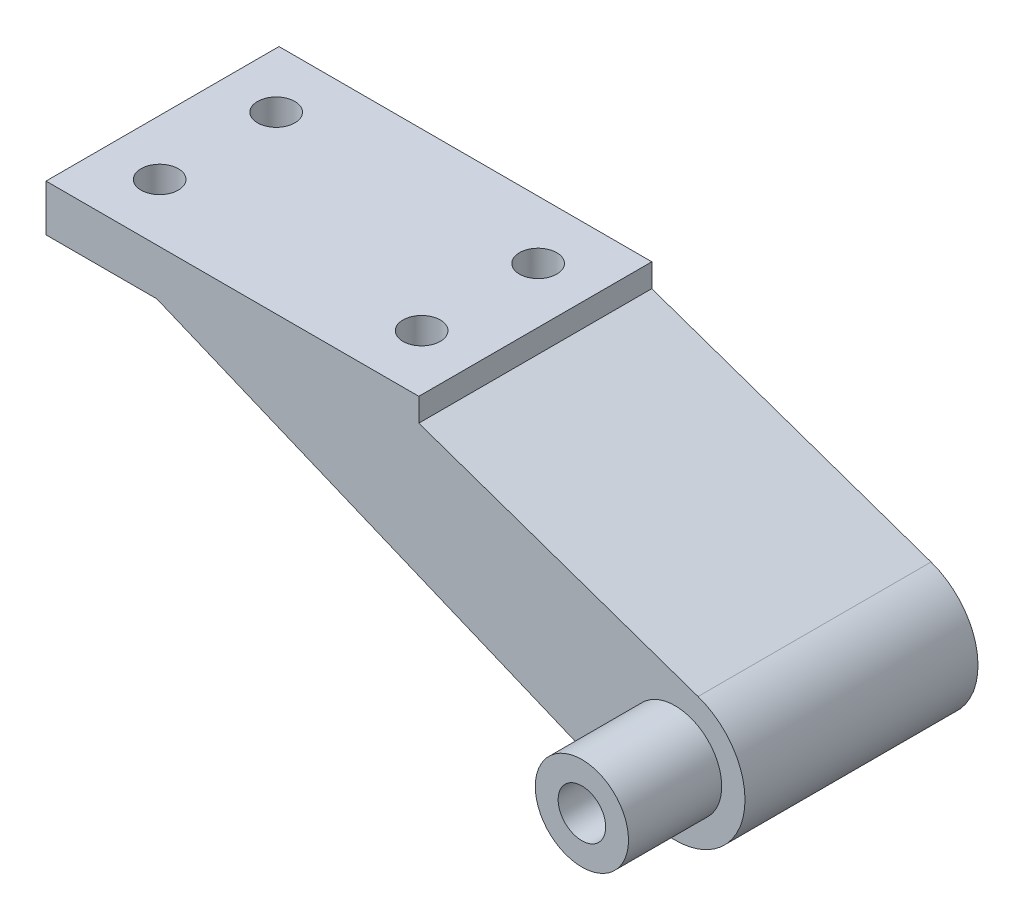
ISO-10303-21;
HEADER;
FILE_DESCRIPTION(('STEP AP214'),'2;1');
FILE_NAME('part.step','',(''),(''),'','','');
FILE_SCHEMA(('AUTOMOTIVE_DESIGN { 1 0 10303 214 1 1 1 1 }'));
ENDSEC;
DATA;
#1=APPLICATION_CONTEXT('core data for automotive mechanical design processes');
#2=APPLICATION_PROTOCOL_DEFINITION('international standard','automotive_design',2000,#1);
#3=PRODUCT_CONTEXT('',#1,'mechanical');
#4=PRODUCT('Part','Part','',(#3));
#5=PRODUCT_RELATED_PRODUCT_CATEGORY('part','',(#4));
#6=PRODUCT_DEFINITION_FORMATION('','',#4);
#7=PRODUCT_DEFINITION_CONTEXT('part definition',#1,'design');
#8=PRODUCT_DEFINITION('design','',#6,#7);
#9=PRODUCT_DEFINITION_SHAPE('','',#8);
#10=(LENGTH_UNIT() NAMED_UNIT(*) SI_UNIT(.MILLI.,.METRE.));
#11=(NAMED_UNIT(*) PLANE_ANGLE_UNIT() SI_UNIT($,.RADIAN.));
#12=(NAMED_UNIT(*) SI_UNIT($,.STERADIAN.) SOLID_ANGLE_UNIT());
#13=UNCERTAINTY_MEASURE_WITH_UNIT(LENGTH_MEASURE(1.E-05),#10,'distance_accuracy_value','');
#14=(GEOMETRIC_REPRESENTATION_CONTEXT(3) GLOBAL_UNCERTAINTY_ASSIGNED_CONTEXT((#13)) GLOBAL_UNIT_ASSIGNED_CONTEXT((#10,
#11,#12)) REPRESENTATION_CONTEXT('',''));
#15=CARTESIAN_POINT('',(0.,0.,0.));
#16=DIRECTION('',(0.,0.,1.));
#17=DIRECTION('',(1.,0.,0.));
#18=AXIS2_PLACEMENT_3D('',#15,#16,#17);
#19=CARTESIAN_POINT('',(43.2475049791949,-28.575,-7.9375));
#20=DIRECTION('',(0.,1.,0.));
#21=DIRECTION('',(0.,0.,1.));
#22=AXIS2_PLACEMENT_3D('',#19,#20,#21);
#23=CYLINDRICAL_SURFACE('',#22,2.54);
#24=CARTESIAN_POINT('',(43.2475049791949,6.35,-7.9375));
#25=DIRECTION('',(0.,1.,0.));
#26=DIRECTION('',(0.,0.,1.));
#27=AXIS2_PLACEMENT_3D('',#24,#25,#26);
#28=CIRCLE('',#27,2.54);
#29=CARTESIAN_POINT('',(43.2475049791949,6.35,-5.3975));
#30=VERTEX_POINT('',#29);
#31=EDGE_CURVE('E178',#30,#30,#28,.T.);
#32=ORIENTED_EDGE('',*,*,#31,.T.);
#33=EDGE_LOOP('',(#32));
#34=FACE_BOUND('',#33,.T.);
#35=CARTESIAN_POINT('',(43.2475049791949,0.,-7.9375));
#36=DIRECTION('',(0.,-1.,0.));
#37=DIRECTION('',(0.,0.,-1.));
#38=AXIS2_PLACEMENT_3D('',#35,#36,#37);
#39=CIRCLE('',#38,2.54);
#40=CARTESIAN_POINT('',(43.2475049791949,0.,-10.4775));
#41=VERTEX_POINT('',#40);
#42=EDGE_CURVE('E163',#41,#41,#39,.F.);
#43=ORIENTED_EDGE('',*,*,#42,.F.);
#44=EDGE_LOOP('',(#43));
#45=FACE_BOUND('',#44,.T.);
#46=ADVANCED_FACE('F32',(#34,#45),#23,.F.);
#47=CARTESIAN_POINT('',(43.2475049791949,-28.575,-23.8125));
#48=DIRECTION('',(0.,1.,0.));
#49=DIRECTION('',(0.,0.,1.));
#50=AXIS2_PLACEMENT_3D('',#47,#48,#49);
#51=CYLINDRICAL_SURFACE('',#50,2.54);
#52=CARTESIAN_POINT('',(43.2475049791949,6.35,-23.8125));
#53=DIRECTION('',(0.,1.,0.));
#54=DIRECTION('',(0.,0.,1.));
#55=AXIS2_PLACEMENT_3D('',#52,#53,#54);
#56=CIRCLE('',#55,2.54);
#57=CARTESIAN_POINT('',(43.2475049791949,6.35,-21.2725));
#58=VERTEX_POINT('',#57);
#59=EDGE_CURVE('E162',#58,#58,#56,.T.);
#60=ORIENTED_EDGE('',*,*,#59,.T.);
#61=EDGE_LOOP('',(#60));
#62=FACE_BOUND('',#61,.T.);
#63=CARTESIAN_POINT('',(43.2475049791949,0.,-23.8125));
#64=DIRECTION('',(0.,-1.,0.));
#65=DIRECTION('',(0.,0.,-1.));
#66=AXIS2_PLACEMENT_3D('',#63,#64,#65);
#67=CIRCLE('',#66,2.54);
#68=CARTESIAN_POINT('',(43.2475049791949,0.,-26.3525));
#69=VERTEX_POINT('',#68);
#70=EDGE_CURVE('E156',#69,#69,#67,.F.);
#71=ORIENTED_EDGE('',*,*,#70,.F.);
#72=EDGE_LOOP('',(#71));
#73=FACE_BOUND('',#72,.T.);
#74=ADVANCED_FACE('F228',(#62,#73),#51,.F.);
#75=CARTESIAN_POINT('',(0.,6.35,0.));
#76=DIRECTION('',(0.,0.,-1.));
#77=DIRECTION('',(-1.,0.,0.));
#78=AXIS2_PLACEMENT_3D('',#75,#76,#77);
#79=PLANE('',#78);
#80=DIRECTION('',(-0.944555017323204,0.328353192842039,0.));
#81=VECTOR('',#80,1.);
#82=CARTESIAN_POINT('',(50.8,3.175,0.));
#83=LINE('',#82,#81);
#84=CARTESIAN_POINT('',(88.8525641618204,-10.0531134599965,0.));
#85=VERTEX_POINT('',#84);
#86=CARTESIAN_POINT('',(50.8,3.175,0.));
#87=VERTEX_POINT('',#86);
#88=EDGE_CURVE('E131',#85,#87,#83,.T.);
#89=ORIENTED_EDGE('',*,*,#88,.T.);
#90=DIRECTION('',(0.,-1.,0.));
#91=VECTOR('',#90,1.);
#92=CARTESIAN_POINT('',(50.8,6.35,0.));
#93=LINE('',#92,#91);
#94=CARTESIAN_POINT('',(50.8,6.35,0.));
#95=VERTEX_POINT('',#94);
#96=EDGE_CURVE('E152',#95,#87,#93,.T.);
#97=ORIENTED_EDGE('',*,*,#96,.F.);
#98=DIRECTION('',(1.,0.,0.));
#99=VECTOR('',#98,1.);
#100=CARTESIAN_POINT('',(0.,6.35,0.));
#101=LINE('',#100,#99);
#102=CARTESIAN_POINT('',(0.,6.35,0.));
#103=VERTEX_POINT('',#102);
#104=EDGE_CURVE('E80',#103,#95,#101,.T.);
#105=ORIENTED_EDGE('',*,*,#104,.F.);
#106=DIRECTION('',(0.,-1.,0.));
#107=VECTOR('',#106,1.);
#108=CARTESIAN_POINT('',(0.,6.35,0.));
#109=LINE('',#108,#107);
#110=CARTESIAN_POINT('',(0.,0.,0.));
#111=VERTEX_POINT('',#110);
#112=EDGE_CURVE('E41',#103,#111,#109,.T.);
#113=ORIENTED_EDGE('',*,*,#112,.T.);
#114=DIRECTION('',(1.,0.,0.));
#115=VECTOR('',#114,1.);
#116=CARTESIAN_POINT('',(0.,0.,0.));
#117=LINE('',#116,#115);
#118=CARTESIAN_POINT('',(15.1049900416102,0.,0.));
#119=VERTEX_POINT('',#118);
#120=EDGE_CURVE('E145',#111,#119,#117,.T.);
#121=ORIENTED_EDGE('',*,*,#120,.T.);
#122=DIRECTION('',(0.923352092158858,-0.383954312263658,0.));
#123=VECTOR('',#122,1.);
#124=CARTESIAN_POINT('',(82.0678351756886,-27.8449286778131,0.));
#125=LINE('',#124,#123);
#126=CARTESIAN_POINT('',(82.0678351756886,-27.8449286778131,0.));
#127=VERTEX_POINT('',#126);
#128=EDGE_CURVE('E129',#119,#127,#125,.T.);
#129=ORIENTED_EDGE('',*,*,#128,.T.);
#130=CARTESIAN_POINT('',(85.725,-19.05,0.));
#131=DIRECTION('',(0.,0.,1.));
#132=DIRECTION('',(1.,0.,0.));
#133=AXIS2_PLACEMENT_3D('',#130,#131,#132);
#134=CIRCLE('',#133,9.52500000000001);
#135=EDGE_CURVE('E108',#127,#85,#134,.T.);
#136=ORIENTED_EDGE('',*,*,#135,.T.);
#137=EDGE_LOOP('',(#89,#97,#105,#113,#121,#129,#136));
#138=FACE_BOUND('',#137,.T.);
#139=CARTESIAN_POINT('',(85.725,-19.05,0.));
#140=DIRECTION('',(0.,0.,-1.));
#141=DIRECTION('',(-1.,0.,0.));
#142=AXIS2_PLACEMENT_3D('',#139,#140,#141);
#143=CIRCLE('',#142,6.35);
#144=CARTESIAN_POINT('',(79.375,-19.05,0.));
#145=VERTEX_POINT('',#144);
#146=EDGE_CURVE('E11',#145,#145,#143,.F.);
#147=ORIENTED_EDGE('',*,*,#146,.F.);
#148=EDGE_LOOP('',(#147));
#149=FACE_BOUND('',#148,.T.);
#150=ADVANCED_FACE('F199',(#138,#149),#79,.F.);
#151=CARTESIAN_POINT('',(0.,6.35,0.));
#152=DIRECTION('',(1.,0.,0.));
#153=DIRECTION('',(0.,0.,-1.));
#154=AXIS2_PLACEMENT_3D('',#151,#152,#153);
#155=PLANE('',#154);
#156=DIRECTION('',(0.,0.,1.));
#157=VECTOR('',#156,1.);
#158=CARTESIAN_POINT('',(0.,0.,0.));
#159=LINE('',#158,#157);
#160=CARTESIAN_POINT('',(0.,0.,-31.75));
#161=VERTEX_POINT('',#160);
#162=EDGE_CURVE('E123',#161,#111,#159,.T.);
#163=ORIENTED_EDGE('',*,*,#162,.T.);
#164=ORIENTED_EDGE('',*,*,#112,.F.);
#165=DIRECTION('',(0.,0.,1.));
#166=VECTOR('',#165,1.);
#167=CARTESIAN_POINT('',(0.,6.35,0.));
#168=LINE('',#167,#166);
#169=CARTESIAN_POINT('',(0.,6.35,-31.75));
#170=VERTEX_POINT('',#169);
#171=EDGE_CURVE('E136',#170,#103,#168,.T.);
#172=ORIENTED_EDGE('',*,*,#171,.F.);
#173=DIRECTION('',(0.,-1.,0.));
#174=VECTOR('',#173,1.);
#175=CARTESIAN_POINT('',(0.,6.35,-31.75));
#176=LINE('',#175,#174);
#177=EDGE_CURVE('E142',#170,#161,#176,.T.);
#178=ORIENTED_EDGE('',*,*,#177,.T.);
#179=EDGE_LOOP('',(#163,#164,#172,#178));
#180=FACE_BOUND('',#179,.T.);
#181=ADVANCED_FACE('F34',(#180),#155,.F.);
#182=CARTESIAN_POINT('',(50.8,6.35,0.));
#183=DIRECTION('',(-1.,0.,0.));
#184=DIRECTION('',(0.,0.,1.));
#185=AXIS2_PLACEMENT_3D('',#182,#183,#184);
#186=PLANE('',#185);
#187=ORIENTED_EDGE('',*,*,#96,.T.);
#188=DIRECTION('',(0.,0.,1.));
#189=VECTOR('',#188,1.);
#190=CARTESIAN_POINT('',(50.8,3.175,-111.755878932692));
#191=LINE('',#190,#189);
#192=CARTESIAN_POINT('',(50.8,3.175,-31.75));
#193=VERTEX_POINT('',#192);
#194=EDGE_CURVE('E121',#193,#87,#191,.T.);
#195=ORIENTED_EDGE('',*,*,#194,.F.);
#196=DIRECTION('',(0.,-1.,0.));
#197=VECTOR('',#196,1.);
#198=CARTESIAN_POINT('',(50.8,6.35,-31.75));
#199=LINE('',#198,#197);
#200=CARTESIAN_POINT('',(50.8,6.35,-31.75));
#201=VERTEX_POINT('',#200);
#202=EDGE_CURVE('E150',#201,#193,#199,.T.);
#203=ORIENTED_EDGE('',*,*,#202,.F.);
#204=DIRECTION('',(0.,0.,-1.));
#205=VECTOR('',#204,1.);
#206=CARTESIAN_POINT('',(50.8,6.35,0.));
#207=LINE('',#206,#205);
#208=EDGE_CURVE('E139',#95,#201,#207,.T.);
#209=ORIENTED_EDGE('',*,*,#208,.F.);
#210=EDGE_LOOP('',(#187,#195,#203,#209));
#211=FACE_BOUND('',#210,.T.);
#212=ADVANCED_FACE('F206',(#211),#186,.F.);
#213=CARTESIAN_POINT('',(0.,6.35,-31.75));
#214=DIRECTION('',(0.,0.,1.));
#215=DIRECTION('',(1.,0.,0.));
#216=AXIS2_PLACEMENT_3D('',#213,#214,#215);
#217=PLANE('',#216);
#218=ORIENTED_EDGE('',*,*,#202,.T.);
#219=DIRECTION('',(0.944555017323204,-0.328353192842039,0.));
#220=VECTOR('',#219,1.);
#221=CARTESIAN_POINT('',(50.8,3.175,-31.75));
#222=LINE('',#221,#220);
#223=CARTESIAN_POINT('',(88.8525641618204,-10.0531134599965,-31.75));
#224=VERTEX_POINT('',#223);
#225=EDGE_CURVE('E116',#193,#224,#222,.T.);
#226=ORIENTED_EDGE('',*,*,#225,.T.);
#227=CARTESIAN_POINT('',(85.725,-19.05,-31.75));
#228=DIRECTION('',(0.,0.,1.));
#229=DIRECTION('',(1.,0.,0.));
#230=AXIS2_PLACEMENT_3D('',#227,#228,#229);
#231=CIRCLE('',#230,9.52500000000001);
#232=CARTESIAN_POINT('',(82.0678351756886,-27.8449286778131,-31.75));
#233=VERTEX_POINT('',#232);
#234=EDGE_CURVE('E105',#224,#233,#231,.F.);
#235=ORIENTED_EDGE('',*,*,#234,.T.);
#236=DIRECTION('',(-0.923352092158859,0.383954312263658,0.));
#237=VECTOR('',#236,1.);
#238=CARTESIAN_POINT('',(82.0678351756886,-27.8449286778131,-31.75));
#239=LINE('',#238,#237);
#240=CARTESIAN_POINT('',(15.1049900416102,0.,-31.75));
#241=VERTEX_POINT('',#240);
#242=EDGE_CURVE('E115',#233,#241,#239,.T.);
#243=ORIENTED_EDGE('',*,*,#242,.T.);
#244=DIRECTION('',(-1.,0.,0.));
#245=VECTOR('',#244,1.);
#246=CARTESIAN_POINT('',(0.,0.,-31.75));
#247=LINE('',#246,#245);
#248=EDGE_CURVE('E72',#241,#161,#247,.T.);
#249=ORIENTED_EDGE('',*,*,#248,.T.);
#250=ORIENTED_EDGE('',*,*,#177,.F.);
#251=DIRECTION('',(-1.,0.,0.));
#252=VECTOR('',#251,1.);
#253=CARTESIAN_POINT('',(0.,6.35,-31.75));
#254=LINE('',#253,#252);
#255=EDGE_CURVE('E58',#201,#170,#254,.T.);
#256=ORIENTED_EDGE('',*,*,#255,.F.);
#257=EDGE_LOOP('',(#218,#226,#235,#243,#249,#250,#256));
#258=FACE_BOUND('',#257,.T.);
#259=CARTESIAN_POINT('',(85.725,-19.05,-31.75));
#260=DIRECTION('',(0.,0.,1.));
#261=DIRECTION('',(1.,0.,0.));
#262=AXIS2_PLACEMENT_3D('',#259,#260,#261);
#263=CIRCLE('',#262,3.23850000000001);
#264=CARTESIAN_POINT('',(88.9635,-19.05,-31.75));
#265=VERTEX_POINT('',#264);
#266=EDGE_CURVE('E118',#265,#265,#263,.F.);
#267=ORIENTED_EDGE('',*,*,#266,.F.);
#268=EDGE_LOOP('',(#267));
#269=FACE_BOUND('',#268,.T.);
#270=ADVANCED_FACE('F113',(#258,#269),#217,.F.);
#271=CARTESIAN_POINT('',(0.,6.35,0.));
#272=DIRECTION('',(0.,-1.,0.));
#273=DIRECTION('',(0.,0.,-1.));
#274=AXIS2_PLACEMENT_3D('',#271,#272,#273);
#275=PLANE('',#274);
#276=ORIENTED_EDGE('',*,*,#59,.F.);
#277=EDGE_LOOP('',(#276));
#278=FACE_BOUND('',#277,.T.);
#279=ORIENTED_EDGE('',*,*,#31,.F.);
#280=EDGE_LOOP('',(#279));
#281=FACE_BOUND('',#280,.T.);
#282=CARTESIAN_POINT('',(7.55249502080509,6.35,-23.8125));
#283=DIRECTION('',(0.,-1.,0.));
#284=DIRECTION('',(0.,0.,-1.));
#285=AXIS2_PLACEMENT_3D('',#282,#283,#284);
#286=CIRCLE('',#285,2.54);
#287=CARTESIAN_POINT('',(7.55249502080509,6.35,-26.3525));
#288=VERTEX_POINT('',#287);
#289=EDGE_CURVE('E184',#288,#288,#286,.F.);
#290=ORIENTED_EDGE('',*,*,#289,.F.);
#291=EDGE_LOOP('',(#290));
#292=FACE_BOUND('',#291,.T.);
#293=CARTESIAN_POINT('',(7.55249502080509,6.35,-7.9375));
#294=DIRECTION('',(0.,-1.,0.));
#295=DIRECTION('',(0.,0.,-1.));
#296=AXIS2_PLACEMENT_3D('',#293,#294,#295);
#297=CIRCLE('',#296,2.54);
#298=CARTESIAN_POINT('',(7.55249502080509,6.35,-10.4775));
#299=VERTEX_POINT('',#298);
#300=EDGE_CURVE('E190',#299,#299,#297,.F.);
#301=ORIENTED_EDGE('',*,*,#300,.F.);
#302=EDGE_LOOP('',(#301));
#303=FACE_BOUND('',#302,.T.);
#304=ORIENTED_EDGE('',*,*,#171,.T.);
#305=ORIENTED_EDGE('',*,*,#104,.T.);
#306=ORIENTED_EDGE('',*,*,#208,.T.);
#307=ORIENTED_EDGE('',*,*,#255,.T.);
#308=EDGE_LOOP('',(#304,#305,#306,#307));
#309=FACE_BOUND('',#308,.T.);
#310=ADVANCED_FACE('F212',(#278,#281,#292,#303,#309),#275,.F.);
#311=CARTESIAN_POINT('',(0.,0.,0.));
#312=DIRECTION('',(0.,-1.,0.));
#313=DIRECTION('',(0.,0.,-1.));
#314=AXIS2_PLACEMENT_3D('',#311,#312,#313);
#315=PLANE('',#314);
#316=CARTESIAN_POINT('',(7.55249502080509,0.,-23.8125));
#317=DIRECTION('',(0.,-1.,0.));
#318=DIRECTION('',(0.,0.,-1.));
#319=AXIS2_PLACEMENT_3D('',#316,#317,#318);
#320=CIRCLE('',#319,2.54);
#321=CARTESIAN_POINT('',(7.55249502080509,0.,-26.3525));
#322=VERTEX_POINT('',#321);
#323=EDGE_CURVE('E181',#322,#322,#320,.T.);
#324=ORIENTED_EDGE('',*,*,#323,.F.);
#325=EDGE_LOOP('',(#324));
#326=FACE_BOUND('',#325,.T.);
#327=CARTESIAN_POINT('',(7.55249502080509,0.,-7.9375));
#328=DIRECTION('',(0.,-1.,0.));
#329=DIRECTION('',(0.,0.,-1.));
#330=AXIS2_PLACEMENT_3D('',#327,#328,#329);
#331=CIRCLE('',#330,2.54);
#332=CARTESIAN_POINT('',(7.55249502080509,0.,-10.4775));
#333=VERTEX_POINT('',#332);
#334=EDGE_CURVE('E187',#333,#333,#331,.T.);
#335=ORIENTED_EDGE('',*,*,#334,.F.);
#336=EDGE_LOOP('',(#335));
#337=FACE_BOUND('',#336,.T.);
#338=DIRECTION('',(0.,0.,1.));
#339=VECTOR('',#338,1.);
#340=CARTESIAN_POINT('',(15.1049900416102,0.,-111.755878932692));
#341=LINE('',#340,#339);
#342=EDGE_CURVE('E49',#241,#119,#341,.T.);
#343=ORIENTED_EDGE('',*,*,#342,.T.);
#344=ORIENTED_EDGE('',*,*,#120,.F.);
#345=ORIENTED_EDGE('',*,*,#162,.F.);
#346=ORIENTED_EDGE('',*,*,#248,.F.);
#347=EDGE_LOOP('',(#343,#344,#345,#346));
#348=FACE_BOUND('',#347,.T.);
#349=ADVANCED_FACE('F214',(#326,#337,#348),#315,.T.);
#350=CARTESIAN_POINT('',(50.8,3.175,-111.755878932692));
#351=DIRECTION('',(0.328353192842039,0.944555017323204,0.));
#352=DIRECTION('',(-0.944555017323204,0.328353192842039,0.));
#353=AXIS2_PLACEMENT_3D('',#350,#351,#352);
#354=PLANE('',#353);
#355=ORIENTED_EDGE('',*,*,#225,.F.);
#356=ORIENTED_EDGE('',*,*,#194,.T.);
#357=ORIENTED_EDGE('',*,*,#88,.F.);
#358=DIRECTION('',(0.,0.,1.));
#359=VECTOR('',#358,1.);
#360=CARTESIAN_POINT('',(88.8525641618204,-10.0531134599965,-111.755878932692));
#361=LINE('',#360,#359);
#362=EDGE_CURVE('E110',#224,#85,#361,.T.);
#363=ORIENTED_EDGE('',*,*,#362,.F.);
#364=EDGE_LOOP('',(#355,#356,#357,#363));
#365=FACE_BOUND('',#364,.T.);
#366=ADVANCED_FACE('F202',(#365),#354,.T.);
#367=CARTESIAN_POINT('',(82.0678351756886,-27.8449286778131,-111.755878932692));
#368=DIRECTION('',(-0.383954312263658,-0.923352092158859,0.));
#369=DIRECTION('',(0.923352092158859,-0.383954312263658,0.));
#370=AXIS2_PLACEMENT_3D('',#367,#368,#369);
#371=PLANE('',#370);
#372=CARTESIAN_POINT('',(43.2475049791949,-11.7024048139277,-7.9375));
#373=DIRECTION('',(-0.383954312263658,-0.923352092158859,0.));
#374=DIRECTION('',(0.923352092158859,-0.383954312263658,0.));
#375=AXIS2_PLACEMENT_3D('',#372,#373,#374);
#376=ELLIPSE('',#375,5.15783744948794,4.7625);
#377=CARTESIAN_POINT('',(48.0100049791949,-13.6827787446136,-7.9375));
#378=VERTEX_POINT('',#377);
#379=EDGE_CURVE('E36',#378,#378,#376,.F.);
#380=ORIENTED_EDGE('',*,*,#379,.T.);
#381=EDGE_LOOP('',(#380));
#382=FACE_BOUND('',#381,.T.);
#383=CARTESIAN_POINT('',(43.2475049791949,-11.7024048139277,-23.8125));
#384=DIRECTION('',(-0.383954312263658,-0.923352092158859,0.));
#385=DIRECTION('',(0.923352092158859,-0.383954312263658,0.));
#386=AXIS2_PLACEMENT_3D('',#383,#384,#385);
#387=ELLIPSE('',#386,5.15783744948794,4.7625);
#388=CARTESIAN_POINT('',(48.0100049791949,-13.6827787446136,-23.8125));
#389=VERTEX_POINT('',#388);
#390=EDGE_CURVE('E159',#389,#389,#387,.F.);
#391=ORIENTED_EDGE('',*,*,#390,.T.);
#392=EDGE_LOOP('',(#391));
#393=FACE_BOUND('',#392,.T.);
#394=ORIENTED_EDGE('',*,*,#242,.F.);
#395=DIRECTION('',(0.,0.,1.));
#396=VECTOR('',#395,1.);
#397=CARTESIAN_POINT('',(82.0678351756886,-27.8449286778131,-111.755878932692));
#398=LINE('',#397,#396);
#399=EDGE_CURVE('E102',#233,#127,#398,.T.);
#400=ORIENTED_EDGE('',*,*,#399,.T.);
#401=ORIENTED_EDGE('',*,*,#128,.F.);
#402=ORIENTED_EDGE('',*,*,#342,.F.);
#403=EDGE_LOOP('',(#394,#400,#401,#402));
#404=FACE_BOUND('',#403,.T.);
#405=ADVANCED_FACE('F120',(#382,#393,#404),#371,.T.);
#406=CARTESIAN_POINT('',(85.725,-19.05,-58.6907683632075));
#407=DIRECTION('',(0.,0.,1.));
#408=DIRECTION('',(1.,0.,0.));
#409=AXIS2_PLACEMENT_3D('',#406,#407,#408);
#410=CYLINDRICAL_SURFACE('',#409,9.52500000000001);
#411=ORIENTED_EDGE('',*,*,#234,.F.);
#412=ORIENTED_EDGE('',*,*,#362,.T.);
#413=ORIENTED_EDGE('',*,*,#135,.F.);
#414=ORIENTED_EDGE('',*,*,#399,.F.);
#415=EDGE_LOOP('',(#411,#412,#413,#414));
#416=FACE_BOUND('',#415,.T.);
#417=ADVANCED_FACE('F104',(#416),#410,.T.);
#418=CARTESIAN_POINT('',(85.725,-19.05,-58.6907683632075));
#419=DIRECTION('',(0.,0.,1.));
#420=DIRECTION('',(1.,0.,0.));
#421=AXIS2_PLACEMENT_3D('',#418,#419,#420);
#422=CYLINDRICAL_SURFACE('',#421,3.23850000000001);
#423=ORIENTED_EDGE('',*,*,#266,.T.);
#424=EDGE_LOOP('',(#423));
#425=FACE_BOUND('',#424,.T.);
#426=CARTESIAN_POINT('',(85.725,-19.05,12.7));
#427=DIRECTION('',(0.,0.,1.));
#428=DIRECTION('',(1.,0.,0.));
#429=AXIS2_PLACEMENT_3D('',#426,#427,#428);
#430=CIRCLE('',#429,3.23850000000001);
#431=CARTESIAN_POINT('',(88.9635,-19.05,12.7));
#432=VERTEX_POINT('',#431);
#433=EDGE_CURVE('E193',#432,#432,#430,.T.);
#434=ORIENTED_EDGE('',*,*,#433,.T.);
#435=EDGE_LOOP('',(#434));
#436=FACE_BOUND('',#435,.T.);
#437=ADVANCED_FACE('F252',(#425,#436),#422,.F.);
#438=CARTESIAN_POINT('',(85.725,-19.05,12.7));
#439=DIRECTION('',(0.,0.,1.));
#440=DIRECTION('',(1.,0.,0.));
#441=AXIS2_PLACEMENT_3D('',#438,#439,#440);
#442=PLANE('',#441);
#443=CARTESIAN_POINT('',(85.725,-19.05,12.7));
#444=DIRECTION('',(0.,0.,1.));
#445=DIRECTION('',(1.,0.,0.));
#446=AXIS2_PLACEMENT_3D('',#443,#444,#445);
#447=CIRCLE('',#446,6.35);
#448=CARTESIAN_POINT('',(92.075,-19.05,12.7));
#449=VERTEX_POINT('',#448);
#450=EDGE_CURVE('E196',#449,#449,#447,.T.);
#451=ORIENTED_EDGE('',*,*,#450,.T.);
#452=EDGE_LOOP('',(#451));
#453=FACE_BOUND('',#452,.T.);
#454=ORIENTED_EDGE('',*,*,#433,.F.);
#455=EDGE_LOOP('',(#454));
#456=FACE_BOUND('',#455,.T.);
#457=ADVANCED_FACE('F249',(#453,#456),#442,.T.);
#458=CARTESIAN_POINT('',(85.725,-19.05,12.7));
#459=DIRECTION('',(0.,0.,-1.));
#460=DIRECTION('',(-1.,0.,0.));
#461=AXIS2_PLACEMENT_3D('',#458,#459,#460);
#462=CYLINDRICAL_SURFACE('',#461,6.35);
#463=ORIENTED_EDGE('',*,*,#450,.F.);
#464=EDGE_LOOP('',(#463));
#465=FACE_BOUND('',#464,.T.);
#466=ORIENTED_EDGE('',*,*,#146,.T.);
#467=EDGE_LOOP('',(#466));
#468=FACE_BOUND('',#467,.T.);
#469=ADVANCED_FACE('F247',(#465,#468),#462,.T.);
#470=CARTESIAN_POINT('',(7.55249502080509,6.351,-7.9375));
#471=DIRECTION('',(0.,-1.,0.));
#472=DIRECTION('',(0.,0.,-1.));
#473=AXIS2_PLACEMENT_3D('',#470,#471,#472);
#474=CYLINDRICAL_SURFACE('',#473,2.54);
#475=ORIENTED_EDGE('',*,*,#334,.T.);
#476=EDGE_LOOP('',(#475));
#477=FACE_BOUND('',#476,.T.);
#478=ORIENTED_EDGE('',*,*,#300,.T.);
#479=EDGE_LOOP('',(#478));
#480=FACE_BOUND('',#479,.T.);
#481=ADVANCED_FACE('F243',(#477,#480),#474,.F.);
#482=CARTESIAN_POINT('',(7.55249502080509,6.351,-23.8125));
#483=DIRECTION('',(0.,-1.,0.));
#484=DIRECTION('',(0.,0.,-1.));
#485=AXIS2_PLACEMENT_3D('',#482,#483,#484);
#486=CYLINDRICAL_SURFACE('',#485,2.54);
#487=ORIENTED_EDGE('',*,*,#323,.T.);
#488=EDGE_LOOP('',(#487));
#489=FACE_BOUND('',#488,.T.);
#490=ORIENTED_EDGE('',*,*,#289,.T.);
#491=EDGE_LOOP('',(#490));
#492=FACE_BOUND('',#491,.T.);
#493=ADVANCED_FACE('F239',(#489,#492),#486,.F.);
#494=CARTESIAN_POINT('',(0.,0.,0.));
#495=DIRECTION('',(0.,-1.,0.));
#496=DIRECTION('',(0.,0.,-1.));
#497=AXIS2_PLACEMENT_3D('',#494,#495,#496);
#498=PLANE('',#497);
#499=CARTESIAN_POINT('',(43.2475049791949,0.,-23.8125));
#500=DIRECTION('',(0.,-1.,0.));
#501=DIRECTION('',(0.,0.,-1.));
#502=AXIS2_PLACEMENT_3D('',#499,#500,#501);
#503=CIRCLE('',#502,4.7625);
#504=CARTESIAN_POINT('',(43.2475049791949,0.,-28.575));
#505=VERTEX_POINT('',#504);
#506=EDGE_CURVE('E160',#505,#505,#503,.T.);
#507=ORIENTED_EDGE('',*,*,#506,.T.);
#508=EDGE_LOOP('',(#507));
#509=FACE_BOUND('',#508,.T.);
#510=ORIENTED_EDGE('',*,*,#70,.T.);
#511=EDGE_LOOP('',(#510));
#512=FACE_BOUND('',#511,.T.);
#513=ADVANCED_FACE('F242',(#509,#512),#498,.T.);
#514=CARTESIAN_POINT('',(43.2475049791949,13.4703841816037,-23.8125));
#515=DIRECTION('',(0.,-1.,0.));
#516=DIRECTION('',(0.,0.,-1.));
#517=AXIS2_PLACEMENT_3D('',#514,#515,#516);
#518=CYLINDRICAL_SURFACE('',#517,4.7625);
#519=ORIENTED_EDGE('',*,*,#390,.F.);
#520=EDGE_LOOP('',(#519));
#521=FACE_BOUND('',#520,.T.);
#522=ORIENTED_EDGE('',*,*,#506,.F.);
#523=EDGE_LOOP('',(#522));
#524=FACE_BOUND('',#523,.T.);
#525=ADVANCED_FACE('F271',(#521,#524),#518,.F.);
#526=CARTESIAN_POINT('',(0.,0.,0.));
#527=DIRECTION('',(0.,-1.,0.));
#528=DIRECTION('',(0.,0.,-1.));
#529=AXIS2_PLACEMENT_3D('',#526,#527,#528);
#530=PLANE('',#529);
#531=CARTESIAN_POINT('',(43.2475049791949,0.,-7.9375));
#532=DIRECTION('',(0.,-1.,0.));
#533=DIRECTION('',(0.,0.,-1.));
#534=AXIS2_PLACEMENT_3D('',#531,#532,#533);
#535=CIRCLE('',#534,4.7625);
#536=CARTESIAN_POINT('',(43.2475049791949,0.,-12.7));
#537=VERTEX_POINT('',#536);
#538=EDGE_CURVE('E165',#537,#537,#535,.T.);
#539=ORIENTED_EDGE('',*,*,#538,.T.);
#540=EDGE_LOOP('',(#539));
#541=FACE_BOUND('',#540,.T.);
#542=ORIENTED_EDGE('',*,*,#42,.T.);
#543=EDGE_LOOP('',(#542));
#544=FACE_BOUND('',#543,.T.);
#545=ADVANCED_FACE('F274',(#541,#544),#530,.T.);
#546=CARTESIAN_POINT('',(43.2475049791949,13.4703841816037,-7.9375));
#547=DIRECTION('',(0.,-1.,0.));
#548=DIRECTION('',(0.,0.,-1.));
#549=AXIS2_PLACEMENT_3D('',#546,#547,#548);
#550=CYLINDRICAL_SURFACE('',#549,4.7625);
#551=ORIENTED_EDGE('',*,*,#379,.F.);
#552=EDGE_LOOP('',(#551));
#553=FACE_BOUND('',#552,.T.);
#554=ORIENTED_EDGE('',*,*,#538,.F.);
#555=EDGE_LOOP('',(#554));
#556=FACE_BOUND('',#555,.T.);
#557=ADVANCED_FACE('F285',(#553,#556),#550,.F.);
#558=CLOSED_SHELL('',(#46,#74,#150,#181,#212,#270,#310,#349,#366,#405,#417,#437,#457,#469,#481,
#493,#513,#525,#545,#557));
#559=MANIFOLD_SOLID_BREP('B2',#558);
#560=ADVANCED_BREP_SHAPE_REPRESENTATION('',(#18,#559),#14);
#561=SHAPE_DEFINITION_REPRESENTATION(#9,#560);
ENDSEC;
END-ISO-10303-21;
